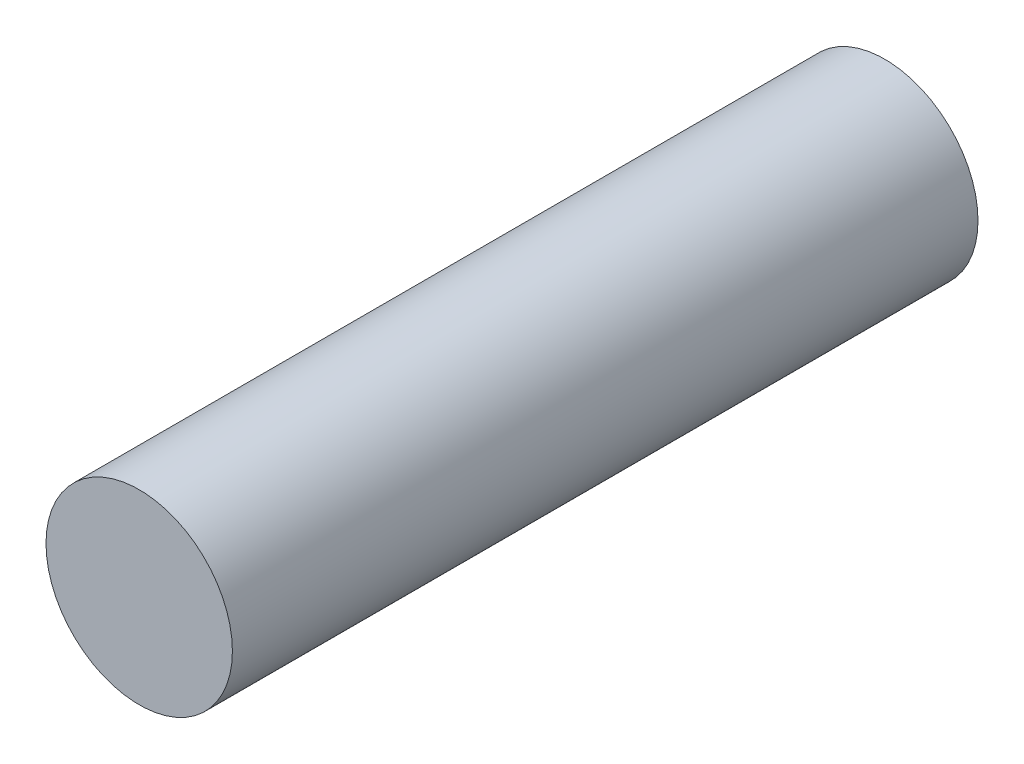
ISO-10303-21;
HEADER;
FILE_DESCRIPTION(('STEP AP214'),'2;1');
FILE_NAME('part.step','',(''),(''),'','','');
FILE_SCHEMA(('AUTOMOTIVE_DESIGN { 1 0 10303 214 1 1 1 1 }'));
ENDSEC;
DATA;
#1=APPLICATION_CONTEXT('core data for automotive mechanical design processes');
#2=APPLICATION_PROTOCOL_DEFINITION('international standard','automotive_design',2000,#1);
#3=PRODUCT_CONTEXT('',#1,'mechanical');
#4=PRODUCT('Part','Part','',(#3));
#5=PRODUCT_RELATED_PRODUCT_CATEGORY('part','',(#4));
#6=PRODUCT_DEFINITION_FORMATION('','',#4);
#7=PRODUCT_DEFINITION_CONTEXT('part definition',#1,'design');
#8=PRODUCT_DEFINITION('design','',#6,#7);
#9=PRODUCT_DEFINITION_SHAPE('','',#8);
#10=(LENGTH_UNIT() NAMED_UNIT(*) SI_UNIT(.MILLI.,.METRE.));
#11=(NAMED_UNIT(*) PLANE_ANGLE_UNIT() SI_UNIT($,.RADIAN.));
#12=(NAMED_UNIT(*) SI_UNIT($,.STERADIAN.) SOLID_ANGLE_UNIT());
#13=UNCERTAINTY_MEASURE_WITH_UNIT(LENGTH_MEASURE(1.E-05),#10,'distance_accuracy_value','');
#14=(GEOMETRIC_REPRESENTATION_CONTEXT(3) GLOBAL_UNCERTAINTY_ASSIGNED_CONTEXT((#13)) GLOBAL_UNIT_ASSIGNED_CONTEXT((#10,
#11,#12)) REPRESENTATION_CONTEXT('',''));
#15=CARTESIAN_POINT('',(0.,0.,0.));
#16=DIRECTION('',(0.,0.,1.));
#17=DIRECTION('',(1.,0.,0.));
#18=AXIS2_PLACEMENT_3D('',#15,#16,#17);
#19=CARTESIAN_POINT('',(0.,0.,80.));
#20=DIRECTION('',(0.,0.,-1.));
#21=DIRECTION('',(-1.,0.,0.));
#22=AXIS2_PLACEMENT_3D('',#19,#20,#21);
#23=CYLINDRICAL_SURFACE('',#22,10.);
#24=CARTESIAN_POINT('',(0.,0.,80.));
#25=DIRECTION('',(0.,0.,1.));
#26=DIRECTION('',(1.,0.,0.));
#27=AXIS2_PLACEMENT_3D('',#24,#25,#26);
#28=CIRCLE('',#27,10.);
#29=CARTESIAN_POINT('',(10.,0.,80.));
#30=VERTEX_POINT('',#29);
#31=EDGE_CURVE('E10',#30,#30,#28,.T.);
#32=ORIENTED_EDGE('',*,*,#31,.F.);
#33=EDGE_LOOP('',(#32));
#34=FACE_BOUND('',#33,.T.);
#35=CARTESIAN_POINT('',(0.,0.,0.));
#36=DIRECTION('',(0.,0.,1.));
#37=DIRECTION('',(1.,0.,0.));
#38=AXIS2_PLACEMENT_3D('',#35,#36,#37);
#39=CIRCLE('',#38,10.);
#40=CARTESIAN_POINT('',(10.,0.,0.));
#41=VERTEX_POINT('',#40);
#42=EDGE_CURVE('E40',#41,#41,#39,.T.);
#43=ORIENTED_EDGE('',*,*,#42,.T.);
#44=EDGE_LOOP('',(#43));
#45=FACE_BOUND('',#44,.T.);
#46=ADVANCED_FACE('F37',(#34,#45),#23,.T.);
#47=CARTESIAN_POINT('',(0.,0.,80.));
#48=DIRECTION('',(0.,0.,1.));
#49=DIRECTION('',(1.,0.,0.));
#50=AXIS2_PLACEMENT_3D('',#47,#48,#49);
#51=PLANE('',#50);
#52=ORIENTED_EDGE('',*,*,#31,.T.);
#53=EDGE_LOOP('',(#52));
#54=FACE_BOUND('',#53,.T.);
#55=ADVANCED_FACE('F54',(#54),#51,.T.);
#56=CARTESIAN_POINT('',(0.,0.,0.));
#57=DIRECTION('',(0.,0.,1.));
#58=DIRECTION('',(1.,0.,0.));
#59=AXIS2_PLACEMENT_3D('',#56,#57,#58);
#60=PLANE('',#59);
#61=ORIENTED_EDGE('',*,*,#42,.F.);
#62=EDGE_LOOP('',(#61));
#63=FACE_BOUND('',#62,.T.);
#64=ADVANCED_FACE('F52',(#63),#60,.F.);
#65=CLOSED_SHELL('',(#46,#55,#64));
#66=MANIFOLD_SOLID_BREP('B2',#65);
#67=ADVANCED_BREP_SHAPE_REPRESENTATION('',(#18,#66),#14);
#68=SHAPE_DEFINITION_REPRESENTATION(#9,#67);
ENDSEC;
END-ISO-10303-21;
